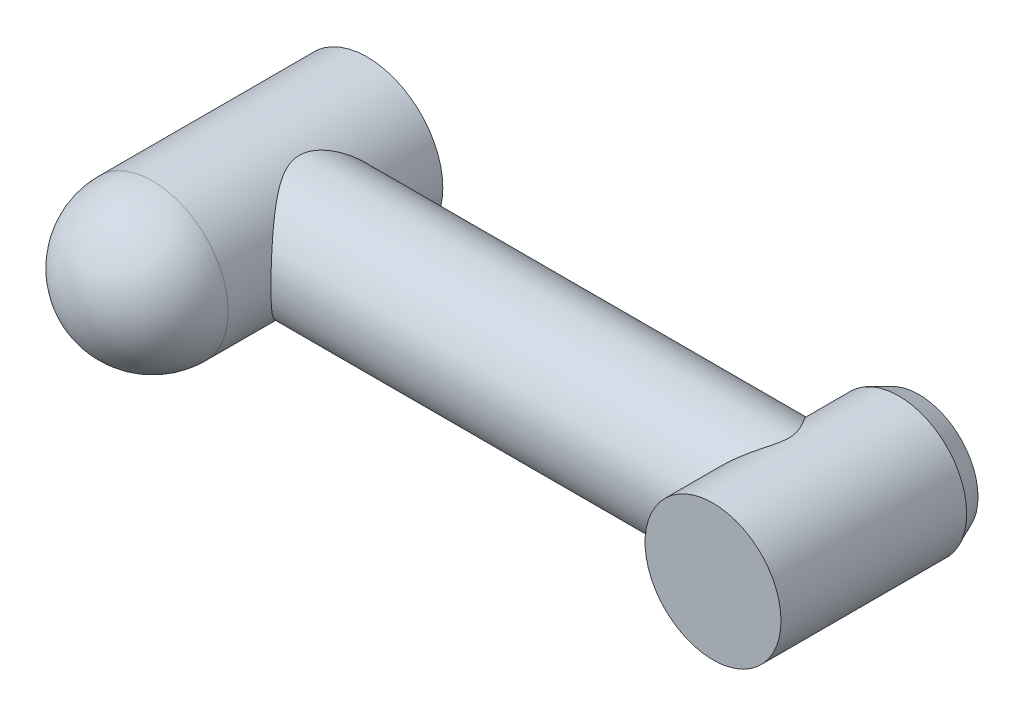
ISO-10303-21;
HEADER;
FILE_DESCRIPTION(('STEP AP214'),'2;1');
FILE_NAME('part.step','',(''),(''),'','','');
FILE_SCHEMA(('AUTOMOTIVE_DESIGN { 1 0 10303 214 1 1 1 1 }'));
ENDSEC;
DATA;
#1=APPLICATION_CONTEXT('core data for automotive mechanical design processes');
#2=APPLICATION_PROTOCOL_DEFINITION('international standard','automotive_design',2000,#1);
#3=PRODUCT_CONTEXT('',#1,'mechanical');
#4=PRODUCT('Part','Part','',(#3));
#5=PRODUCT_RELATED_PRODUCT_CATEGORY('part','',(#4));
#6=PRODUCT_DEFINITION_FORMATION('','',#4);
#7=PRODUCT_DEFINITION_CONTEXT('part definition',#1,'design');
#8=PRODUCT_DEFINITION('design','',#6,#7);
#9=PRODUCT_DEFINITION_SHAPE('','',#8);
#10=(LENGTH_UNIT() NAMED_UNIT(*) SI_UNIT(.MILLI.,.METRE.));
#11=(NAMED_UNIT(*) PLANE_ANGLE_UNIT() SI_UNIT($,.RADIAN.));
#12=(NAMED_UNIT(*) SI_UNIT($,.STERADIAN.) SOLID_ANGLE_UNIT());
#13=UNCERTAINTY_MEASURE_WITH_UNIT(LENGTH_MEASURE(1.E-05),#10,'distance_accuracy_value','');
#14=(GEOMETRIC_REPRESENTATION_CONTEXT(3) GLOBAL_UNCERTAINTY_ASSIGNED_CONTEXT((#13)) GLOBAL_UNIT_ASSIGNED_CONTEXT((#10,
#11,#12)) REPRESENTATION_CONTEXT('',''));
#15=CARTESIAN_POINT('',(0.,0.,0.));
#16=DIRECTION('',(0.,0.,1.));
#17=DIRECTION('',(1.,0.,0.));
#18=AXIS2_PLACEMENT_3D('',#15,#16,#17);
#19=CARTESIAN_POINT('',(0.,0.,230.5));
#20=DIRECTION('',(0.,0.,-1.));
#21=DIRECTION('',(-1.,0.,0.));
#22=AXIS2_PLACEMENT_3D('',#19,#20,#21);
#23=CYLINDRICAL_SURFACE('',#22,60.);
#24=CARTESIAN_POINT('',(0.,0.,170.5));
#25=DIRECTION('',(0.,0.,-1.));
#26=DIRECTION('',(-1.,0.,0.));
#27=AXIS2_PLACEMENT_3D('',#24,#25,#26);
#28=CIRCLE('',#27,60.);
#29=CARTESIAN_POINT('',(-60.,0.,170.5));
#30=VERTEX_POINT('',#29);
#31=EDGE_CURVE('E48',#30,#30,#28,.T.);
#32=ORIENTED_EDGE('',*,*,#31,.T.);
#33=EDGE_LOOP('',(#32));
#34=FACE_BOUND('',#33,.T.);
#35=CARTESIAN_POINT('',(0.,0.,0.));
#36=DIRECTION('',(0.,0.,1.));
#37=DIRECTION('',(1.,0.,0.));
#38=AXIS2_PLACEMENT_3D('',#35,#36,#37);
#39=CIRCLE('',#38,60.);
#40=CARTESIAN_POINT('',(60.,0.,0.));
#41=VERTEX_POINT('',#40);
#42=EDGE_CURVE('E57',#41,#41,#39,.T.);
#43=ORIENTED_EDGE('',*,*,#42,.T.);
#44=EDGE_LOOP('',(#43));
#45=FACE_BOUND('',#44,.T.);
#46=CARTESIAN_POINT('',(60.,0.,136.5));
#47=CARTESIAN_POINT('',(60.0000016990028,-0.601928228781382,136.500001744688));
#48=CARTESIAN_POINT('',(59.990938591183,-1.20382373694948,136.489340379008));
#49=CARTESIAN_POINT('',(59.9547426443786,-2.40637749412046,136.446749633626));
#50=CARTESIAN_POINT('',(59.9276084873752,-3.00703564967096,136.41481870262));
#51=CARTESIAN_POINT('',(59.8554201579515,-4.20587281870443,136.329832023823));
#52=CARTESIAN_POINT('',(59.810362902836,-4.80405138781683,136.276772642029));
#53=CARTESIAN_POINT('',(59.7025854606123,-5.9966510654528,136.149776281436));
#54=CARTESIAN_POINT('',(59.6398633090962,-6.59107174856334,136.075836980703));
#55=CARTESIAN_POINT('',(59.49704470274,-7.77545704488494,135.907344047787));
#56=CARTESIAN_POINT('',(59.4169322525582,-8.36541703478289,135.81277143698));
#57=CARTESIAN_POINT('',(59.2398167281469,-9.53921704084182,135.603482619148));
#58=CARTESIAN_POINT('',(59.1428117772453,-10.1230563693795,135.48876417401));
#59=CARTESIAN_POINT('',(58.8272416429912,-11.8635895803341,135.115141988051));
#60=CARTESIAN_POINT('',(58.5840704294233,-13.0097154477721,134.826711680961));
#61=CARTESIAN_POINT('',(58.0388768665048,-15.2584327986765,134.177940443527));
#62=CARTESIAN_POINT('',(57.7372378983688,-16.3612544505703,133.818067618758));
#63=CARTESIAN_POINT('',(57.0796235977744,-18.5255384112223,133.030310999894));
#64=CARTESIAN_POINT('',(56.7236488303845,-19.5870011499509,132.602427913074));
#65=CARTESIAN_POINT('',(55.9632361094469,-21.6642529274438,131.683873530652));
#66=CARTESIAN_POINT('',(55.558797861743,-22.6800416889318,131.193201853945));
#67=CARTESIAN_POINT('',(54.7073067850168,-24.6632383629957,130.153983127062));
#68=CARTESIAN_POINT('',(54.2602447602425,-25.6306357665595,129.605423585284));
#69=CARTESIAN_POINT('',(53.4746794134052,-27.2209796021024,128.634618995732));
#70=CARTESIAN_POINT('',(53.1457846466191,-27.8572851334094,128.226312188266));
#71=CARTESIAN_POINT('',(52.4726377083691,-29.1054119518997,127.386045897262));
#72=CARTESIAN_POINT('',(52.1283887819964,-29.7172383613588,126.954091407297));
#73=CARTESIAN_POINT('',(51.0750060594728,-31.5162626693242,125.624182862888));
#74=CARTESIAN_POINT('',(50.3453642100952,-32.6667494621251,124.692340987029));
#75=CARTESIAN_POINT('',(48.8446970180098,-34.8708827811849,122.745007538877));
#76=CARTESIAN_POINT('',(48.0735748547477,-35.9242856560844,121.729317014214));
#77=CARTESIAN_POINT('',(46.5061124470045,-37.9315384227759,119.622067120703));
#78=CARTESIAN_POINT('',(45.7097754993761,-38.8854012600193,118.530517648354));
#79=CARTESIAN_POINT('',(44.5002790613235,-40.250528996006,116.827907181099));
#80=CARTESIAN_POINT('',(44.090583206239,-40.6986245838529,116.243517657961));
#81=CARTESIAN_POINT('',(43.2709019356836,-41.5690538433231,115.055977250405));
#82=CARTESIAN_POINT('',(42.8609165182517,-41.991387338754,114.452826237716));
#83=CARTESIAN_POINT('',(42.0429688185456,-42.8103240518685,113.227591415116));
#84=CARTESIAN_POINT('',(41.6350072773656,-43.2069184065225,112.605501190859));
#85=CARTESIAN_POINT('',(40.8239388355854,-43.974055469358,111.342376897452));
#86=CARTESIAN_POINT('',(40.4208318762143,-44.3445984931874,110.701343057963));
#87=CARTESIAN_POINT('',(39.6233813242977,-45.0585554477164,109.401366317247));
#88=CARTESIAN_POINT('',(39.2290204975744,-45.4020269255776,108.742465639544));
#89=CARTESIAN_POINT('',(38.4516002399348,-46.0622894051371,107.404835920583));
#90=CARTESIAN_POINT('',(38.0685414095986,-46.3790789906313,106.726105829404));
#91=CARTESIAN_POINT('',(37.3180371139106,-46.9850671184351,105.348657975082));
#92=CARTESIAN_POINT('',(36.9505810387266,-47.2742845819158,104.649954352912));
#93=CARTESIAN_POINT('',(36.2357863258661,-47.8243780375567,103.23153650654));
#94=CARTESIAN_POINT('',(35.8884440950874,-48.0852590990193,102.511826069724));
#95=CARTESIAN_POINT('',(35.1967418646254,-48.5940929609231,101.001334157578));
#96=CARTESIAN_POINT('',(34.8541641051659,-48.8399860461943,100.209033711318));
#97=CARTESIAN_POINT('',(34.2060168007339,-49.2961001467494,98.5993928311455));
#98=CARTESIAN_POINT('',(33.9004427432072,-49.5063255129227,97.7820554657164));
#99=CARTESIAN_POINT('',(33.3357128627411,-49.8883392291809,96.1242891646486));
#100=CARTESIAN_POINT('',(33.0764722289052,-50.0601979541041,95.2839057359428));
#101=CARTESIAN_POINT('',(32.6132797314552,-50.3631882036835,93.5806824934261));
#102=CARTESIAN_POINT('',(32.4093277915902,-50.4943197845082,92.7178427105876));
#103=CARTESIAN_POINT('',(32.0635334320261,-50.7146234508423,90.9608773987049));
#104=CARTESIAN_POINT('',(31.9226382974755,-50.8031569859697,90.0664792897973));
#105=CARTESIAN_POINT('',(31.767008834103,-50.9004968905557,88.7161505373581));
#106=CARTESIAN_POINT('',(31.7244158822507,-50.9270346566141,88.2645236195518));
#107=CARTESIAN_POINT('',(31.6583905581338,-50.9681067767805,87.3593440595888));
#108=CARTESIAN_POINT('',(31.6349557224106,-50.982642674159,86.9057916725613));
#109=CARTESIAN_POINT('',(31.6076309143704,-50.9995873245383,85.9980897566058));
#110=CARTESIAN_POINT('',(31.6037318403365,-51.0020017249492,85.5439406043801));
#111=CARTESIAN_POINT('',(31.6155095236265,-50.9947017579526,84.6360114569342));
#112=CARTESIAN_POINT('',(31.6311855359927,-50.984987852105,84.1822314483233));
#113=CARTESIAN_POINT('',(31.6818680480592,-50.953509516958,83.2761934586466));
#114=CARTESIAN_POINT('',(31.7168736270457,-50.9317456616264,82.8239354061186));
#115=CARTESIAN_POINT('',(31.8056696688981,-50.8763409190579,81.9219853811647));
#116=CARTESIAN_POINT('',(31.859461940153,-50.8426988884359,81.4722936600081));
#117=CARTESIAN_POINT('',(32.0294422349581,-50.7358957567759,80.2600400295487));
#118=CARTESIAN_POINT('',(32.1628666099571,-50.6516043842811,79.5008066065905));
#119=CARTESIAN_POINT('',(32.4770630051097,-50.4507175456719,77.9965825165636));
#120=CARTESIAN_POINT('',(32.6578417916458,-50.3341174628891,77.2515939012446));
#121=CARTESIAN_POINT('',(32.9600485638631,-50.1363109775967,76.1463504400453));
#122=CARTESIAN_POINT('',(33.0660468403134,-50.0664978409514,75.7797101887628));
#123=CARTESIAN_POINT('',(33.2875766182136,-49.9194844461914,75.0509232843829));
#124=CARTESIAN_POINT('',(33.403105655428,-49.842286096749,74.6887754974161));
#125=CARTESIAN_POINT('',(33.7629265986134,-49.5998827917749,73.6089964857748));
#126=CARTESIAN_POINT('',(34.0204240249039,-49.4238879538893,72.8981316786486));
#127=CARTESIAN_POINT('',(34.5422225738903,-49.0604470223479,71.5530580949367));
#128=CARTESIAN_POINT('',(34.8042141676275,-48.8751399338626,70.9173599223662));
#129=CARTESIAN_POINT('',(35.3487614083546,-48.4827566017566,69.6615950238943));
#130=CARTESIAN_POINT('',(35.6313200265698,-48.2756772108612,69.0415305740169));
#131=CARTESIAN_POINT('',(36.21348265045,-47.8405250048013,67.8164766333469));
#132=CARTESIAN_POINT('',(36.5130975003405,-47.612438775407,67.2114970929409));
#133=CARTESIAN_POINT('',(37.1259767779055,-47.1361060126164,66.0166448569896));
#134=CARTESIAN_POINT('',(37.4392406498837,-46.8878602996236,65.4267715479699));
#135=CARTESIAN_POINT('',(38.0773817454971,-46.3711325258369,64.2602733461656));
#136=CARTESIAN_POINT('',(38.4022849755632,-46.1026034430055,63.6836835499283));
#137=CARTESIAN_POINT('',(39.0605404024953,-45.5462409822371,62.5447929612811));
#138=CARTESIAN_POINT('',(39.3938933177944,-45.2584059593679,61.9824933920902));
#139=CARTESIAN_POINT('',(40.4030539816053,-44.3666322635369,60.3168957886381));
#140=CARTESIAN_POINT('',(41.0882527544011,-43.7341935473179,59.2343784826));
#141=CARTESIAN_POINT('',(42.5203514950763,-42.3448780121012,57.0444907067525));
#142=CARTESIAN_POINT('',(43.2680364921754,-41.5822343054055,55.9413061988843));
#143=CARTESIAN_POINT('',(44.7604366233255,-39.9713549547925,53.7968616477341));
#144=CARTESIAN_POINT('',(45.5051514186289,-39.1231098228186,52.7556084892934));
#145=CARTESIAN_POINT('',(46.9777441919459,-37.3420065421821,50.7381993334676));
#146=CARTESIAN_POINT('',(47.7056412584662,-36.4092509014396,49.7619668989188));
#147=CARTESIAN_POINT('',(49.1335462492809,-34.4580318382516,47.8770881971078));
#148=CARTESIAN_POINT('',(49.8335573388285,-33.4395781842062,46.968434249007));
#149=CARTESIAN_POINT('',(51.1364075761642,-31.4069912306731,45.2982435786343));
#150=CARTESIAN_POINT('',(51.7424545420775,-30.3998039918888,44.5307650167732));
#151=CARTESIAN_POINT('',(52.9124226413697,-28.3143908992902,43.0627405222187));
#152=CARTESIAN_POINT('',(53.4763433127977,-27.2361642667118,42.3621953234836));
#153=CARTESIAN_POINT('',(54.5523353420667,-25.0113676255313,41.0353194828715));
#154=CARTESIAN_POINT('',(55.0644419362061,-23.8648449163711,40.4089383555055));
#155=CARTESIAN_POINT('',(56.0276468555526,-21.5063773310798,39.23761511881));
#156=CARTESIAN_POINT('',(56.478756516998,-20.2944446700849,38.692657874925));
#157=CARTESIAN_POINT('',(57.2410731875537,-18.0180583971792,37.7758560156496));
#158=CARTESIAN_POINT('',(57.5630650084877,-16.9627256422854,37.3902982019261));
#159=CARTESIAN_POINT('',(58.1528220427973,-14.8151516315462,36.6861932149717));
#160=CARTESIAN_POINT('',(58.4205926528863,-13.7229140615285,36.3676393726187));
#161=CARTESIAN_POINT('',(58.8969386846675,-11.5079567384847,35.8021873039512));
#162=CARTESIAN_POINT('',(59.105544775467,-10.3852531100768,35.5552519512594));
#163=CARTESIAN_POINT('',(59.4596424240504,-8.11600047833874,35.1367044248311));
#164=CARTESIAN_POINT('',(59.6051333173088,-6.96945122407649,34.9650930441633));
#165=CARTESIAN_POINT('',(59.8303886480648,-4.65621493093314,34.6996026077104));
#166=CARTESIAN_POINT('',(59.9098861642193,-3.48946540978627,34.6060392228566));
#167=CARTESIAN_POINT('',(60.0004089708273,-1.14962077460204,34.4995110785759));
#168=CARTESIAN_POINT('',(60.0114341734912,0.0234743475691851,34.4865464224859));
#169=CARTESIAN_POINT('',(59.9647656313801,2.36639603508192,34.5414548739631));
#170=CARTESIAN_POINT('',(59.9070711398552,3.53622256476645,34.6093288599718));
#171=CARTESIAN_POINT('',(59.7242448413245,5.8631517023647,34.8246740574));
#172=CARTESIAN_POINT('',(59.59911466552,7.02025461735906,34.9721433434892));
#173=CARTESIAN_POINT('',(59.2939714990952,9.24133291363725,35.33244473327));
#174=CARTESIAN_POINT('',(59.1178740702416,10.3066113162256,35.5406196534778));
#175=CARTESIAN_POINT('',(58.7119588793188,12.4118936319,36.0216132108837));
#176=CARTESIAN_POINT('',(58.482144987397,13.4518993598675,36.2944271910056));
#177=CARTESIAN_POINT('',(57.9725734187682,15.5014866423223,36.9011688222239));
#178=CARTESIAN_POINT('',(57.6928086810682,16.5110638718593,37.2351051136668));
#179=CARTESIAN_POINT('',(57.0876204116586,18.4954083501375,37.9601616906407));
#180=CARTESIAN_POINT('',(56.7621903508331,19.4701705960715,38.3512901537052));
#181=CARTESIAN_POINT('',(55.9543887511719,21.7012750459559,39.3265074644919));
#182=CARTESIAN_POINT('',(55.455928231889,22.9427668397205,39.9313831945074));
#183=CARTESIAN_POINT('',(54.3966129086768,25.3523592672962,41.2266400070653));
#184=CARTESIAN_POINT('',(53.8357408548031,26.5204394705661,41.9170447349985));
#185=CARTESIAN_POINT('',(52.6613407103926,28.7821067926307,43.3763138456111));
#186=CARTESIAN_POINT('',(52.0477131295118,29.8755458617249,44.1453270137603));
#187=CARTESIAN_POINT('',(50.7793955835645,31.983856929797,45.7534135245157));
#188=CARTESIAN_POINT('',(50.1247055619713,32.9987288206145,46.5924869635679));
#189=CARTESIAN_POINT('',(48.6171205236475,35.1931936282864,48.5525966309581));
#190=CARTESIAN_POINT('',(47.7555187787576,36.3507328812386,49.6917598331887));
#191=CARTESIAN_POINT('',(46.4423523232287,37.9947491876261,51.4698528764276));
#192=CARTESIAN_POINT('',(46.0010280156662,38.5275249622439,52.0743088397932));
#193=CARTESIAN_POINT('',(45.1140377333124,39.5624538671383,53.3059136047462));
#194=CARTESIAN_POINT('',(44.6683718449771,40.064607605766,53.9330619551218));
#195=CARTESIAN_POINT('',(43.7755815040018,41.038210569651,55.2095788707251));
#196=CARTESIAN_POINT('',(43.3284572120372,41.5096630648246,55.8589450583091));
#197=CARTESIAN_POINT('',(42.4357111867218,42.4219008361925,57.1799250257581));
#198=CARTESIAN_POINT('',(41.9900895041595,42.8626850854858,57.85153954948));
#199=CARTESIAN_POINT('',(41.1039362091969,43.7131942971771,59.2168638745918));
#200=CARTESIAN_POINT('',(40.6634023185742,44.1229336572787,59.910563219062));
#201=CARTESIAN_POINT('',(39.7910907679571,44.9111864440101,61.3207171087514));
#202=CARTESIAN_POINT('',(39.3593122201631,45.2897030487176,62.0371693277115));
#203=CARTESIAN_POINT('',(38.4159664574296,46.094216692092,63.6526676634546));
#204=CARTESIAN_POINT('',(37.9075661655904,46.5125314109318,64.5574214796273));
#205=CARTESIAN_POINT('',(36.9198039624893,47.3003924308968,66.4034061980593));
#206=CARTESIAN_POINT('',(36.4404414266753,47.6699397811258,67.3446363150615));
#207=CARTESIAN_POINT('',(35.5234342551012,48.35714284719,69.2635128329203));
#208=CARTESIAN_POINT('',(35.085716462952,48.6748902868205,70.241091015653));
#209=CARTESIAN_POINT('',(34.2656321620888,49.2556485871084,72.2350670902585));
#210=CARTESIAN_POINT('',(33.8832485046041,49.518676417194,73.2514528312152));
#211=CARTESIAN_POINT('',(33.2795811494356,49.9256070864136,75.0569564854494));
#212=CARTESIAN_POINT('',(33.0421129497751,50.0827693892625,75.8376688516394));
#213=CARTESIAN_POINT('',(32.6149543088861,50.3619891548517,77.4183045171422));
#214=CARTESIAN_POINT('',(32.4252580254018,50.4840509104649,78.2182254542283));
#215=CARTESIAN_POINT('',(32.1013591328088,50.6906281224531,79.8324762639301));
#216=CARTESIAN_POINT('',(31.9670477265874,50.7752172140255,80.6467745789106));
#217=CARTESIAN_POINT('',(31.7595185760057,50.9052860659427,82.2863020453545));
#218=CARTESIAN_POINT('',(31.6862984390904,50.9507673578926,83.1115307674577));
#219=CARTESIAN_POINT('',(31.6044349514742,51.0015894965328,84.7712664268398));
#220=CARTESIAN_POINT('',(31.5961675686738,51.006696645464,85.6057994215467));
#221=CARTESIAN_POINT('',(31.6456425630219,50.9760148857895,87.2721113145405));
#222=CARTESIAN_POINT('',(31.7033847781936,50.9402260775358,88.1038902195803));
#223=CARTESIAN_POINT('',(31.8819901323243,50.828630145925,89.7590468174903));
#224=CARTESIAN_POINT('',(32.0029440569988,50.7527654632289,90.5824106858969));
#225=CARTESIAN_POINT('',(32.3022461672095,50.5627936101713,92.2140926012997));
#226=CARTESIAN_POINT('',(32.4806039007546,50.4486800777256,93.0224081216184));
#227=CARTESIAN_POINT('',(32.9544634925807,50.1408733982303,94.8835918992239));
#228=CARTESIAN_POINT('',(33.2691999864242,49.9333479949782,95.9292741578807));
#229=CARTESIAN_POINT('',(33.9690109061735,49.4599264030424,97.9831025320429));
#230=CARTESIAN_POINT('',(34.3541149775487,49.1940056031379,98.991232610708));
#231=CARTESIAN_POINT('',(35.1791052092895,48.6074836117474,100.971997831806));
#232=CARTESIAN_POINT('',(35.6191561805948,48.2867167951201,101.944514296865));
#233=CARTESIAN_POINT('',(36.538897473557,47.5945394177989,103.851817507669));
#234=CARTESIAN_POINT('',(37.0185876278058,47.2231290709836,104.786604412732));
#235=CARTESIAN_POINT('',(37.9092375243432,46.5096625707101,106.440279500475));
#236=CARTESIAN_POINT('',(38.3152344347341,46.1761271507411,107.165565215436));
#237=CARTESIAN_POINT('',(39.1405272786443,45.4786871113815,108.593735746481));
#238=CARTESIAN_POINT('',(39.5598247515088,45.114778968785,109.296617950676));
#239=CARTESIAN_POINT('',(40.4076407442474,44.3570292298406,110.6808823714));
#240=CARTESIAN_POINT('',(40.8361637051934,43.9631729748025,111.362253825146));
#241=CARTESIAN_POINT('',(41.6985708063181,43.1460550043251,112.703576997377));
#242=CARTESIAN_POINT('',(42.1324547460593,42.7227943855442,113.363529513353));
#243=CARTESIAN_POINT('',(43.0023682228689,41.8470697390214,114.662237311446));
#244=CARTESIAN_POINT('',(43.438397650704,41.3946071841142,115.300993660162));
#245=CARTESIAN_POINT('',(44.3097465931627,40.4605281573044,116.557340347918));
#246=CARTESIAN_POINT('',(44.7450660966161,39.9789112311396,117.174930356926));
#247=CARTESIAN_POINT('',(45.6121838044054,38.9866976798693,118.388469564918));
#248=CARTESIAN_POINT('',(46.0439832572567,38.476111891157,118.984426721091));
#249=CARTESIAN_POINT('',(46.9017333858359,37.4257573725246,120.154447956155));
#250=CARTESIAN_POINT('',(47.3276837354072,36.8859870234404,120.728510817326));
#251=CARTESIAN_POINT('',(48.4722365170899,35.3817212422548,122.255487172974));
#252=CARTESIAN_POINT('',(49.1829361079735,34.3888254501452,123.186652121967));
#253=CARTESIAN_POINT('',(50.5683567158088,32.3170931780404,124.977591021849));
#254=CARTESIAN_POINT('',(51.2430766907507,31.238254211289,125.837362905516));
#255=CARTESIAN_POINT('',(52.5438617880722,28.9968800947269,127.477451068981));
#256=CARTESIAN_POINT('',(53.1699949782118,27.834466597108,128.257878999665));
#257=CARTESIAN_POINT('',(54.3624559527958,25.4268889745745,129.731936515126));
#258=CARTESIAN_POINT('',(54.928799466491,24.1817467547825,130.425588937415));
#259=CARTESIAN_POINT('',(55.8796537294604,21.8787457956903,131.582757924634));
#260=CARTESIAN_POINT('',(56.2775495281226,20.8353917690828,132.064204295715));
#261=CARTESIAN_POINT('',(57.0217770816656,18.702723889323,132.960991318157));
#262=CARTESIAN_POINT('',(57.3681110383668,17.6134120012381,133.37633479233));
#263=CARTESIAN_POINT('',(58.0026917484509,15.3953423949838,134.134919141161));
#264=CARTESIAN_POINT('',(58.2910217811422,14.2666440001343,134.478263419363));
#265=CARTESIAN_POINT('',(58.8046069063445,11.9748068532626,135.088395536297));
#266=CARTESIAN_POINT('',(59.0298790975538,10.8116775322694,135.355204128852));
#267=CARTESIAN_POINT('',(59.349254865252,8.84883368457987,135.732862428388));
#268=CARTESIAN_POINT('',(59.4620896959247,8.05636433074545,135.866097519287));
#269=CARTESIAN_POINT('',(59.656399494723,6.4620905758569,136.095352881692));
#270=CARTESIAN_POINT('',(59.7378710288592,5.66028516248732,136.191369078082));
#271=CARTESIAN_POINT('',(59.8685875178258,4.05027991019745,136.345348054519));
#272=CARTESIAN_POINT('',(59.9178266124038,3.24207893550446,136.403303914736));
#273=CARTESIAN_POINT('',(59.9835296651962,1.62256522833785,136.480626305908));
#274=CARTESIAN_POINT('',(59.9999977101573,0.811252896513804,136.499997648584));
#275=CARTESIAN_POINT('',(60.,0.,136.5));
#276=B_SPLINE_CURVE_WITH_KNOTS('',3,(#46,#47,#48,#49,#50,#51,#52,#53,#54,#55,#56,#57,#58,#59,
#60,#61,#62,#63,#64,#65,#66,#67,#68,#69,#70,#71,#72,#73,#74,#75,#76,#77,#78,#79,#80,#81,#82,#83,
#84,#85,#86,#87,#88,#89,#90,#91,#92,#93,#94,#95,#96,#97,#98,#99,#100,#101,#102,#103,#104,#105,
#106,#107,#108,#109,#110,#111,#112,#113,#114,#115,#116,#117,#118,#119,#120,#121,#122,#123,#124,
#125,#126,#127,#128,#129,#130,#131,#132,#133,#134,#135,#136,#137,#138,#139,#140,#141,#142,#143,
#144,#145,#146,#147,#148,#149,#150,#151,#152,#153,#154,#155,#156,#157,#158,#159,#160,#161,#162,
#163,#164,#165,#166,#167,#168,#169,#170,#171,#172,#173,#174,#175,#176,#177,#178,#179,#180,#181,
#182,#183,#184,#185,#186,#187,#188,#189,#190,#191,#192,#193,#194,#195,#196,#197,#198,#199,#200,
#201,#202,#203,#204,#205,#206,#207,#208,#209,#210,#211,#212,#213,#214,#215,#216,#217,#218,#219,
#220,#221,#222,#223,#224,#225,#226,#227,#228,#229,#230,#231,#232,#233,#234,#235,#236,#237,#238,
#239,#240,#241,#242,#243,#244,#245,#246,#247,#248,#249,#250,#251,#252,#253,#254,#255,#256,#257,
#258,#259,#260,#261,#262,#263,#264,#265,#266,#267,#268,#269,#270,#271,#272,#273,#274,#275),
.UNSPECIFIED.,.T.,.F.,(4,2,2,2,2,2,2,2,2,2,2,2,2,2,2,2,2,2,2,2,2,2,2,2,2,2,2,2,2,2,2,2,2,2,2,2,
2,2,2,2,2,2,2,2,2,2,2,2,2,2,2,2,2,2,2,2,2,2,2,2,2,2,2,2,2,2,2,2,2,2,2,2,2,2,2,2,2,2,2,2,2,2,2,2,
2,2,2,2,2,2,2,2,2,2,2,2,2,2,2,2,2,2,2,2,2,2,2,2,2,2,2,2,2,2,4),(0.,1.80556576549967,
3.61126323505959,5.41727141114242,7.22348050198624,9.03135801051498,10.8394364934332,
14.4543257683192,18.0462680115357,21.6381729026772,25.2300995965224,28.8228029820555,
31.2954253817676,33.7675276480086,38.7127087321717,43.669980748805,48.6266072532208,
51.1542361369822,53.6818823057867,56.2103942776343,58.7388756077873,61.2618283257889,
63.7849148711423,66.306257311279,68.8271479448589,71.5181158623682,74.2087552885961,
76.8944180425064,79.5800770924915,82.3048288411022,83.6675757527587,85.0301474071467,
86.3920841799377,87.7539691238753,89.1157892035571,90.4777404068853,92.8015347638407,
95.1256613446831,96.2894412136227,97.4529211177222,99.7802028300518,101.915690126417,
104.051486541672,106.188656384769,108.325739297868,110.467938272541,112.610320002349,
116.893171532629,121.496013058843,126.099365325251,130.697206807018,135.294524905933,
139.502299415819,143.710120060794,147.915059656505,152.119216689768,155.6220928121,
159.124620116676,162.625328484128,166.126073708849,169.640910234547,173.155751266673,
176.670630493537,180.18542470282,183.480713933253,186.775765818826,190.071283858378,
193.367273564031,197.765527291885,202.164999688194,206.572959004584,210.98092438913,
216.488361417069,219.243806941931,221.999197708037,224.754294522419,227.509483544607,
230.263386869222,233.017009534886,236.371961461869,239.72684120397,243.075714262631,
246.423547228821,248.914606230236,251.405360440046,253.891198274833,256.376938750655,
258.87705698551,261.377169085497,263.880881796435,266.38501116677,269.714312930651,
273.045020558414,276.385969947905,279.726905228276,282.412843175174,285.099093122418,
287.786666477598,290.474139651421,293.161477385081,295.848857001669,298.53523789344,
301.221767979292,305.823997331777,310.42635989766,315.0221537854,319.616735599632,
323.261369843546,326.90584840773,330.54505645786,334.183276746105,336.616335300932,
339.049660177327,341.483427339203,343.916890976676),.UNSPECIFIED.);
#277=CARTESIAN_POINT('',(60.,0.,136.5));
#278=VERTEX_POINT('',#277);
#279=EDGE_CURVE('E44',#278,#278,#276,.T.);
#280=ORIENTED_EDGE('',*,*,#279,.F.);
#281=EDGE_LOOP('',(#280));
#282=FACE_BOUND('',#281,.T.);
#283=ADVANCED_FACE('F33',(#34,#45,#282),#23,.T.);
#284=CARTESIAN_POINT('',(0.,0.,0.));
#285=DIRECTION('',(0.,0.,1.));
#286=DIRECTION('',(1.,0.,0.));
#287=AXIS2_PLACEMENT_3D('',#284,#285,#286);
#288=PLANE('',#287);
#289=ORIENTED_EDGE('',*,*,#42,.F.);
#290=EDGE_LOOP('',(#289));
#291=FACE_BOUND('',#290,.T.);
#292=ADVANCED_FACE('F82',(#291),#288,.F.);
#293=CARTESIAN_POINT('',(0.,0.,170.5));
#294=DIRECTION('',(0.,0.,1.));
#295=DIRECTION('',(1.,0.,0.));
#296=AXIS2_PLACEMENT_3D('',#293,#294,#295);
#297=SPHERICAL_SURFACE('',#296,60.);
#298=ORIENTED_EDGE('',*,*,#31,.F.);
#299=EDGE_LOOP('',(#298));
#300=FACE_BOUND('',#299,.T.);
#301=ADVANCED_FACE('F87',(#300),#297,.T.);
#302=CARTESIAN_POINT('',(438.15,0.,85.5));
#303=DIRECTION('',(-1.,0.,0.));
#304=DIRECTION('',(0.,0.,1.));
#305=AXIS2_PLACEMENT_3D('',#302,#303,#304);
#306=CYLINDRICAL_SURFACE('',#305,51.);
#307=CARTESIAN_POINT('',(384.175,0.,136.5));
#308=CARTESIAN_POINT('',(384.175008567837,1.16216833662785,136.499991363593));
#309=CARTESIAN_POINT('',(384.21261449314,2.32447110122438,136.460196427347));
#310=CARTESIAN_POINT('',(384.362210518301,4.63894572327149,136.301833948972));
#311=CARTESIAN_POINT('',(384.47421228886,5.79111596246385,136.183254047607));
#312=CARTESIAN_POINT('',(384.770229415357,8.07646994062947,135.869653194199));
#313=CARTESIAN_POINT('',(384.954299287674,9.20963862744668,135.67457437388));
#314=CARTESIAN_POINT('',(385.390596853786,11.4475263842736,135.211768705011));
#315=CARTESIAN_POINT('',(385.642823557903,12.5522458671282,134.94404291134));
#316=CARTESIAN_POINT('',(386.208721241677,14.7190349500372,134.342666740921));
#317=CARTESIAN_POINT('',(386.521978592509,15.7813366628627,134.00946002911));
#318=CARTESIAN_POINT('',(387.205620858209,17.8654335469899,133.281218930187));
#319=CARTESIAN_POINT('',(387.576004728933,18.887229458218,132.886185673125));
#320=CARTESIAN_POINT('',(388.368279227206,20.8862888335811,132.039674677878));
#321=CARTESIAN_POINT('',(388.790167796861,21.8635540748193,131.588199194853));
#322=CARTESIAN_POINT('',(389.680001559554,23.7711557010081,130.633910316828));
#323=CARTESIAN_POINT('',(390.147957329635,24.7014812340772,130.131085130925));
#324=CARTESIAN_POINT('',(390.979558576426,26.2445075548982,129.235212781341));
#325=CARTESIAN_POINT('',(391.332983406337,26.8695840881424,128.853831375099));
#326=CARTESIAN_POINT('',(392.058015618994,28.0951322114224,128.069855476238));
#327=CARTESIAN_POINT('',(392.429619180117,28.6956089245969,127.667265440845));
#328=CARTESIAN_POINT('',(393.569540804119,30.4605499600143,126.429457929331));
#329=CARTESIAN_POINT('',(394.362825071122,31.5882591199146,125.564358670672));
#330=CARTESIAN_POINT('',(396.004882792995,33.748129581109,123.762880099073));
#331=CARTESIAN_POINT('',(396.853807151443,34.7800110054783,122.82630570244));
#332=CARTESIAN_POINT('',(398.593426315953,36.7464361609817,120.892105692498));
#333=CARTESIAN_POINT('',(399.484117390544,37.6809885636291,119.894485530647));
#334=CARTESIAN_POINT('',(400.975466837663,39.1411083212302,118.206895910399));
#335=CARTESIAN_POINT('',(401.567304953432,39.6944354646039,117.532888363783));
#336=CARTESIAN_POINT('',(402.760780862041,40.7620500949958,116.162836621296));
#337=CARTESIAN_POINT('',(403.362419270537,41.2763351178071,115.466791038382));
#338=CARTESIAN_POINT('',(404.572695983587,42.2667378085748,114.052906213676));
#339=CARTESIAN_POINT('',(405.18133888071,42.7428285866523,113.335052099828));
#340=CARTESIAN_POINT('',(406.401767290346,43.6569755402028,111.878173655974));
#341=CARTESIAN_POINT('',(407.013552685642,44.0950331235705,111.139150110956));
#342=CARTESIAN_POINT('',(408.234921646691,44.9325677486476,109.641230428533));
#343=CARTESIAN_POINT('',(408.844507004158,45.3321332511821,108.882385210912));
#344=CARTESIAN_POINT('',(410.058288901872,46.094140118042,107.341906246824));
#345=CARTESIAN_POINT('',(410.662484885057,46.456577684396,106.560270179471));
#346=CARTESIAN_POINT('',(411.858751838946,47.1438877058472,104.973084966251));
#347=CARTESIAN_POINT('',(412.450835417561,47.4688010490386,104.16756307405));
#348=CARTESIAN_POINT('',(413.615419560718,48.0810464729684,102.528748197121));
#349=CARTESIAN_POINT('',(414.187925710984,48.3683893402985,101.695463269833));
#350=CARTESIAN_POINT('',(415.123665770932,48.818701858993,100.26824001479));
#351=CARTESIAN_POINT('',(415.495240809426,48.9920465152482,99.6830416929386));
#352=CARTESIAN_POINT('',(416.219064865996,49.3203044971932,98.4956565541741));
#353=CARTESIAN_POINT('',(416.571313791189,49.4752177343035,97.8934696556327));
#354=CARTESIAN_POINT('',(417.249811620592,49.7656393445798,96.6703221934093));
#355=CARTESIAN_POINT('',(417.576072095777,49.9011563752796,96.0493701564254));
#356=CARTESIAN_POINT('',(418.194177132883,50.1515387530876,94.7864105845475));
#357=CARTESIAN_POINT('',(418.4860283924,50.26640812146,94.1444071784039));
#358=CARTESIAN_POINT('',(418.963679757817,50.4503304948903,92.9850940506878));
#359=CARTESIAN_POINT('',(419.158561916479,50.5238758758326,92.4722587752131));
#360=CARTESIAN_POINT('',(419.51489809357,50.656388940882,91.4333218673315));
#361=CARTESIAN_POINT('',(419.676364340186,50.715361959124,90.9072251671391));
#362=CARTESIAN_POINT('',(419.959012085028,50.8174301709106,89.8442939692008));
#363=CARTESIAN_POINT('',(420.080308217901,50.8605705852185,89.3074947438191));
#364=CARTESIAN_POINT('',(420.277121825039,50.93006830183,88.2244142426342));
#365=CARTESIAN_POINT('',(420.352644103446,50.9564273654159,87.6781339680961));
#366=CARTESIAN_POINT('',(420.453962715343,50.9917042658117,86.5743250395853));
#367=CARTESIAN_POINT('',(420.479209201279,51.0004292606338,86.0167386674711));
#368=CARTESIAN_POINT('',(420.476637831294,50.999538146299,84.9017200299112));
#369=CARTESIAN_POINT('',(420.44882099128,50.9899223882796,84.3442877617194));
#370=CARTESIAN_POINT('',(420.341879845234,50.952670145813,83.2340417717707));
#371=CARTESIAN_POINT('',(420.262662480133,50.9250009757109,82.6812382725698));
#372=CARTESIAN_POINT('',(420.057638314202,50.8525198495003,81.5855414869308));
#373=CARTESIAN_POINT('',(419.931821158899,50.8077040833451,81.0426504311906));
#374=CARTESIAN_POINT('',(419.590734805571,50.6842895206007,79.7883612538546));
#375=CARTESIAN_POINT('',(419.359607202647,50.5993939803939,79.0819176222744));
#376=CARTESIAN_POINT('',(418.841362027599,50.4039047504299,77.6936791787144));
#377=CARTESIAN_POINT('',(418.554214640477,50.2932973702184,77.0118977225669));
#378=CARTESIAN_POINT('',(417.93665070446,50.0482956984954,75.6696769340056));
#379=CARTESIAN_POINT('',(417.606073561833,49.9138124366678,75.0093287514875));
#380=CARTESIAN_POINT('',(416.913488556659,49.6231028787349,73.7105794729115));
#381=CARTESIAN_POINT('',(416.551484561679,49.4668792566994,73.072175689711));
#382=CARTESIAN_POINT('',(415.757300430252,49.1129266186918,71.7356770984985));
#383=CARTESIAN_POINT('',(415.322018915173,48.9124487928512,71.0401658430735));
#384=CARTESIAN_POINT('',(414.430636558635,48.4864588893042,69.6703511257145));
#385=CARTESIAN_POINT('',(413.974530555487,48.2609405848529,68.9960529925242));
#386=CARTESIAN_POINT('',(413.047490980018,47.7853156608263,67.6656788295057));
#387=CARTESIAN_POINT('',(412.576544502076,47.5351872148403,67.009619649003));
#388=CARTESIAN_POINT('',(411.625008621607,47.0108562406277,65.7144653790507));
#389=CARTESIAN_POINT('',(411.144420045481,46.736655768816,65.075368846586));
#390=CARTESIAN_POINT('',(410.17655594115,46.1638793173444,63.811799599364));
#391=CARTESIAN_POINT('',(409.689272074199,45.86527010714,63.1873483620569));
#392=CARTESIAN_POINT('',(408.711603840027,45.2439716310842,61.9530172096917));
#393=CARTESIAN_POINT('',(408.221219432541,44.9212820519245,61.3431374843591));
#394=CARTESIAN_POINT('',(407.239990300573,44.2518310426529,60.1376147294075));
#395=CARTESIAN_POINT('',(406.749145852772,43.905079691362,59.5419658777406));
#396=CARTESIAN_POINT('',(405.768872227111,43.187177612897,58.364355424569));
#397=CARTESIAN_POINT('',(405.279443064909,42.8160266168777,57.7823939739734));
#398=CARTESIAN_POINT('',(404.234775845311,41.9947607784304,56.5506850938765));
#399=CARTESIAN_POINT('',(403.680031644187,41.540906105616,55.9030065792804));
#400=CARTESIAN_POINT('',(402.577313028077,40.6006116223058,54.625751781785));
#401=CARTESIAN_POINT('',(402.029338759969,40.1141711063026,53.9961758912429));
#402=CARTESIAN_POINT('',(400.942350527432,39.1080565075387,52.7555661405123));
#403=CARTESIAN_POINT('',(400.403339751647,38.5883709039763,52.1445388175209));
#404=CARTESIAN_POINT('',(399.336818346252,37.515460194888,50.9422305710913));
#405=CARTESIAN_POINT('',(398.809307439449,36.9622358989956,50.3509491715148));
#406=CARTESIAN_POINT('',(397.769398830138,35.823187301159,49.1907960604353));
#407=CARTESIAN_POINT('',(397.256966376465,35.2374487093105,48.6218716067493));
#408=CARTESIAN_POINT('',(396.248277109378,34.031814270642,47.5064434500648));
#409=CARTESIAN_POINT('',(395.75202080682,33.4119173467356,46.9599404550124));
#410=CARTESIAN_POINT('',(394.291646483715,31.5010027580516,45.3571420570525));
#411=CARTESIAN_POINT('',(393.355026066016,30.1577892714313,44.3365601214413));
#412=CARTESIAN_POINT('',(391.87940798872,27.8127565238799,42.7363802615824));
#413=CARTESIAN_POINT('',(391.313275657737,26.8496210186442,42.1245984050312));
#414=CARTESIAN_POINT('',(390.229618892387,24.8639503821336,40.9566519837165));
#415=CARTESIAN_POINT('',(389.712087197472,23.8414241604179,40.4004791106075));
#416=CARTESIAN_POINT('',(388.732980301484,21.7394345979208,39.3504917723132));
#417=CARTESIAN_POINT('',(388.271391406018,20.6599852847283,38.8566620447402));
#418=CARTESIAN_POINT('',(387.411405908751,18.4473161274382,37.9381418342261));
#419=CARTESIAN_POINT('',(387.013011008114,17.3140948368808,37.5134532125358));
#420=CARTESIAN_POINT('',(386.466718578794,15.5728838950453,36.9318478564774));
#421=CARTESIAN_POINT('',(386.292414733779,14.982460884722,36.7464149074371));
#422=CARTESIAN_POINT('',(385.962765608747,13.790408323946,36.3959231669178));
#423=CARTESIAN_POINT('',(385.807417955531,13.1887801871991,36.2308618250089));
#424=CARTESIAN_POINT('',(385.516523207043,11.9752729639153,35.9219306826301));
#425=CARTESIAN_POINT('',(385.380979300127,11.363392244374,35.7780642944668));
#426=CARTESIAN_POINT('',(385.130535306419,10.1307664545403,35.5123517035893));
#427=CARTESIAN_POINT('',(385.015632421576,9.51002259804888,35.3905025162584));
#428=CARTESIAN_POINT('',(384.807245062091,8.26143994468591,35.169589482197));
#429=CARTESIAN_POINT('',(384.713743796269,7.6336071183051,35.0705077724264));
#430=CARTESIAN_POINT('',(384.548658275113,6.37193213140098,34.8956124132824));
#431=CARTESIAN_POINT('',(384.477071048436,5.73809079760294,34.8197956093957));
#432=CARTESIAN_POINT('',(384.356280067398,4.46592202227584,34.6918891893386));
#433=CARTESIAN_POINT('',(384.307074818412,3.82759488319204,34.6397979888163));
#434=CARTESIAN_POINT('',(384.231372483793,2.54816076940695,34.5596630153593));
#435=CARTESIAN_POINT('',(384.204874471993,1.90705390915498,34.5316182616356));
#436=CARTESIAN_POINT('',(384.164100155666,0.167411497048121,34.4884631311465));
#437=CARTESIAN_POINT('',(384.171894361707,-0.932394139172794,34.4967110418317));
#438=CARTESIAN_POINT('',(384.254434929867,-3.12638249494674,34.5840742235865));
#439=CARTESIAN_POINT('',(384.329173668951,-4.22056584044794,34.6631814258438));
#440=CARTESIAN_POINT('',(384.544069344362,-6.39519525563545,34.8907461189026));
#441=CARTESIAN_POINT('',(384.684226531197,-7.47564127270069,35.0392038752703));
#442=CARTESIAN_POINT('',(385.027268773585,-9.61509208934046,35.4028186532139));
#443=CARTESIAN_POINT('',(385.230155693506,-10.6740962506521,35.6179776571952));
#444=CARTESIAN_POINT('',(385.687029497451,-12.7281721940781,36.1029451626988));
#445=CARTESIAN_POINT('',(385.939029609088,-13.7241915671274,36.3706310189821));
#446=CARTESIAN_POINT('',(386.494220856684,-15.685004973909,36.9610570328422));
#447=CARTESIAN_POINT('',(386.797408971578,-16.6498008464188,37.2837939413723));
#448=CARTESIAN_POINT('',(387.450787390176,-18.5444014348278,37.9802769315803));
#449=CARTESIAN_POINT('',(387.800981193988,-19.4742035384357,38.3540268117887));
#450=CARTESIAN_POINT('',(388.544105884328,-21.2961028483366,39.1484752688299));
#451=CARTESIAN_POINT('',(388.937045658755,-22.1881921594982,39.5691836099142));
#452=CARTESIAN_POINT('',(389.646925962929,-23.6904711445749,40.3307522758648));
#453=CARTESIAN_POINT('',(389.954721378244,-24.3102273917928,40.6613991134506));
#454=CARTESIAN_POINT('',(390.588682920273,-25.5282806080991,41.343527313088));
#455=CARTESIAN_POINT('',(390.91484561225,-26.1265815553657,41.69500478039));
#456=CARTESIAN_POINT('',(391.918943584978,-27.8894064656564,42.7789943499797));
#457=CARTESIAN_POINT('',(392.622372480251,-29.0216086197727,43.5409390703841));
#458=CARTESIAN_POINT('',(394.086930359517,-31.2005592034946,45.1347600310051));
#459=CARTESIAN_POINT('',(394.848194896425,-32.2470941403789,45.9668010899265));
#460=CARTESIAN_POINT('',(396.41646772801,-34.2524840348603,47.6910622540016));
#461=CARTESIAN_POINT('',(397.223474793649,-35.2113413464264,48.5832807423934));
#462=CARTESIAN_POINT('',(398.600070806165,-36.7393992251432,50.1168201301623));
#463=CARTESIAN_POINT('',(399.159805161551,-37.3325034114265,50.7434088970809));
#464=CARTESIAN_POINT('',(400.292579876412,-38.4807314135922,52.0191129448943));
#465=CARTESIAN_POINT('',(400.865621178154,-39.035852528837,52.6682298226268));
#466=CARTESIAN_POINT('',(402.022421318465,-40.1088693148037,53.9880602695922));
#467=CARTESIAN_POINT('',(402.606185266444,-40.6267466288636,54.6587842558662));
#468=CARTESIAN_POINT('',(403.781279862339,-41.6255479767611,56.0207380262676));
#469=CARTESIAN_POINT('',(404.372610291906,-42.1064730741529,56.7119672194224));
#470=CARTESIAN_POINT('',(405.559150270853,-43.0314109420935,58.1138331336667));
#471=CARTESIAN_POINT('',(406.154354890065,-43.475463371302,58.8244478818611));
#472=CARTESIAN_POINT('',(407.345922351484,-44.3277103837534,60.2659896219152));
#473=CARTESIAN_POINT('',(407.942285249662,-44.7359031877416,60.9969176192957));
#474=CARTESIAN_POINT('',(409.131785366147,-45.5164751126045,62.479317679979));
#475=CARTESIAN_POINT('',(409.724924398417,-45.8888768981907,63.2307763497628));
#476=CARTESIAN_POINT('',(410.903404397358,-46.5982439654404,64.7560573583061));
#477=CARTESIAN_POINT('',(411.488746476619,-46.9352143513544,65.5298764552884));
#478=CARTESIAN_POINT('',(412.556598356446,-47.5246381762618,66.9817715895764));
#479=CARTESIAN_POINT('',(413.041110781457,-47.7821276081062,67.65632943836));
#480=CARTESIAN_POINT('',(413.994840201241,-48.2712740733168,69.0253951752787));
#481=CARTESIAN_POINT('',(414.464057529391,-48.5029316699913,69.7199026279621));
#482=CARTESIAN_POINT('',(415.380249568871,-48.9397237588364,71.1316496014429));
#483=CARTESIAN_POINT('',(415.827224543263,-49.144858564742,71.8488888532235));
#484=CARTESIAN_POINT('',(416.689327199544,-49.5273875781134,73.3095198431282));
#485=CARTESIAN_POINT('',(417.104461634344,-49.7047876760378,74.052905986826));
#486=CARTESIAN_POINT('',(417.782620332187,-49.9856623102971,75.3633296450882));
#487=CARTESIAN_POINT('',(418.056303985649,-50.0961194414611,75.9233313770349));
#488=CARTESIAN_POINT('',(418.572785718133,-50.3002020865413,77.0606029130918));
#489=CARTESIAN_POINT('',(418.815582055482,-50.3938266514256,77.6378736887038));
#490=CARTESIAN_POINT('',(419.261280356227,-50.5625711294725,78.8085786279993));
#491=CARTESIAN_POINT('',(419.464290650698,-50.6377414359315,79.4019637471111));
#492=CARTESIAN_POINT('',(419.82165121033,-50.7681854123772,80.6054023347392));
#493=CARTESIAN_POINT('',(419.976021450074,-50.8234672511114,81.2154488489314));
#494=CARTESIAN_POINT('',(420.198977425576,-50.9025749513859,82.3125384894201));
#495=CARTESIAN_POINT('',(420.278984173463,-50.9306534571899,82.7969513920058));
#496=CARTESIAN_POINT('',(420.400185919609,-50.973021534986,83.7712292142589));
#497=CARTESIAN_POINT('',(420.441386475241,-50.9873130813936,84.2610933430951));
#498=CARTESIAN_POINT('',(420.48288853976,-51.0017087874271,85.2424380249356));
#499=CARTESIAN_POINT('',(420.483218501572,-51.0018228170301,85.7339172152086));
#500=CARTESIAN_POINT('',(420.443035975041,-50.9878856228133,86.7150038863851));
#501=CARTESIAN_POINT('',(420.402521273423,-50.9738336313701,87.2046112644164));
#502=CARTESIAN_POINT('',(420.283005782005,-50.9320632424321,88.1758211412867));
#503=CARTESIAN_POINT('',(420.204208741974,-50.9044171871802,88.6574522136004));
#504=CARTESIAN_POINT('',(420.01173863924,-50.8361531219888,89.6127852809125));
#505=CARTESIAN_POINT('',(419.898057399787,-50.7955320706588,90.0864853894359));
#506=CARTESIAN_POINT('',(419.639967251604,-50.7020524737317,91.0249107762216));
#507=CARTESIAN_POINT('',(419.495510843218,-50.6491749998399,91.4896209556076));
#508=CARTESIAN_POINT('',(419.180479843927,-50.5320308800483,92.4085795665327));
#509=CARTESIAN_POINT('',(419.009903589004,-50.4677635084905,92.8628273294195));
#510=CARTESIAN_POINT('',(418.638704026957,-50.3254527351431,93.7809567398686));
#511=CARTESIAN_POINT('',(418.43707429014,-50.2469197006518,94.2443526359541));
#512=CARTESIAN_POINT('',(418.014130907974,-50.078929674593,95.1601019106205));
#513=CARTESIAN_POINT('',(417.792813014495,-49.989470323885,95.612452879063));
#514=CARTESIAN_POINT('',(417.333941820402,-49.8001402704518,96.5070551077893));
#515=CARTESIAN_POINT('',(417.096375477456,-49.700261169392,96.949297865371));
#516=CARTESIAN_POINT('',(416.608115750087,-49.4905908910241,97.8241088638541));
#517=CARTESIAN_POINT('',(416.357420650497,-49.3807984172495,98.2566758301031));
#518=CARTESIAN_POINT('',(415.587260151151,-49.0361065852381,99.5446928807347));
#519=CARTESIAN_POINT('',(415.051707091879,-48.7867006233528,100.386683614107));
#520=CARTESIAN_POINT('',(413.953182559371,-48.2513075828423,102.039817363907));
#521=CARTESIAN_POINT('',(413.390220126089,-47.9653325152298,102.850970395908));
#522=CARTESIAN_POINT('',(412.233099334455,-47.3503366554531,104.466017620059));
#523=CARTESIAN_POINT('',(411.638517245127,-47.0204523388368,105.269277985062));
#524=CARTESIAN_POINT('',(410.438651387304,-46.323465829312,106.851433842663));
#525=CARTESIAN_POINT('',(409.833365957533,-45.9563578162666,107.630325500085));
#526=CARTESIAN_POINT('',(408.61751288198,-45.1846410888288,109.166162562284));
#527=CARTESIAN_POINT('',(408.006941572434,-44.7800040953208,109.92309084389));
#528=CARTESIAN_POINT('',(406.78560132813,-43.9332148811054,111.415411108933));
#529=CARTESIAN_POINT('',(406.174832406676,-43.4910648078996,112.150804321944));
#530=CARTESIAN_POINT('',(404.957865367704,-42.5695256034027,113.599307825319));
#531=CARTESIAN_POINT('',(404.351661502243,-42.0901971602914,114.312451872234));
#532=CARTESIAN_POINT('',(403.146179642016,-41.0931271108779,115.717494453342));
#533=CARTESIAN_POINT('',(402.546901870658,-40.5753842694559,116.409392303404));
#534=CARTESIAN_POINT('',(401.35873146572,-39.50119267805,117.770840562493));
#535=CARTESIAN_POINT('',(400.769833097375,-38.9447661989146,118.440403506854));
#536=CARTESIAN_POINT('',(399.605144385542,-37.7924050792276,119.75637129846));
#537=CARTESIAN_POINT('',(399.029352974203,-37.1964736728128,120.402778034768));
#538=CARTESIAN_POINT('',(397.645759231422,-35.6953195159375,121.948014906729));
#539=CARTESIAN_POINT('',(396.846439425366,-34.7686730205573,122.833810685197));
#540=CARTESIAN_POINT('',(395.290108913546,-32.8310008286397,124.548674843134));
#541=CARTESIAN_POINT('',(394.533098038417,-31.8199754699162,125.377743449687));
#542=CARTESIAN_POINT('',(393.072139884968,-29.7140938150757,126.970632810284));
#543=CARTESIAN_POINT('',(392.368128456279,-28.6193422068299,127.734532598746));
#544=CARTESIAN_POINT('',(391.023029223164,-26.3456422751068,129.188982700497));
#545=CARTESIAN_POINT('',(390.381926389697,-25.1667141784759,129.879550536253));
#546=CARTESIAN_POINT('',(389.298514208127,-22.9782901655349,131.04341196086));
#547=CARTESIAN_POINT('',(388.842437933085,-21.9838168603961,131.532181032626));
#548=CARTESIAN_POINT('',(387.983437559637,-19.945898778602,132.451145141949));
#549=CARTESIAN_POINT('',(387.580510280941,-18.9024569371586,132.881343684252));
#550=CARTESIAN_POINT('',(386.83447227129,-16.7717034754772,133.676776223855));
#551=CARTESIAN_POINT('',(386.491297357788,-15.6844404913039,134.042079936101));
#552=CARTESIAN_POINT('',(385.87032449323,-13.4705942036447,134.70240303984));
#553=CARTESIAN_POINT('',(385.592514720995,-12.3440180522647,134.997435139959));
#554=CARTESIAN_POINT('',(385.157990686317,-10.295881557001,135.458553336813));
#555=CARTESIAN_POINT('',(384.988111534932,-9.38024253621068,135.638691652508));
#556=CARTESIAN_POINT('',(384.6951150574,-7.53324699844968,135.949249333771));
#557=CARTESIAN_POINT('',(384.571990691735,-6.6018928696571,136.079676184034));
#558=CARTESIAN_POINT('',(384.374251420323,-4.72829544949503,136.28909036986));
#559=CARTESIAN_POINT('',(384.299635898314,-3.78605229661579,136.368078358909));
#560=CARTESIAN_POINT('',(384.200002866465,-1.89590314563571,136.473540748613));
#561=CARTESIAN_POINT('',(384.174993011101,-0.94799629622109,136.500007044833));
#562=CARTESIAN_POINT('',(384.175,0.,136.5));
#563=B_SPLINE_CURVE_WITH_KNOTS('',3,(#307,#308,#309,#310,#311,#312,#313,#314,#315,#316,#317,
#318,#319,#320,#321,#322,#323,#324,#325,#326,#327,#328,#329,#330,#331,#332,#333,#334,#335,#336,
#337,#338,#339,#340,#341,#342,#343,#344,#345,#346,#347,#348,#349,#350,#351,#352,#353,#354,#355,
#356,#357,#358,#359,#360,#361,#362,#363,#364,#365,#366,#367,#368,#369,#370,#371,#372,#373,#374,
#375,#376,#377,#378,#379,#380,#381,#382,#383,#384,#385,#386,#387,#388,#389,#390,#391,#392,#393,
#394,#395,#396,#397,#398,#399,#400,#401,#402,#403,#404,#405,#406,#407,#408,#409,#410,#411,#412,
#413,#414,#415,#416,#417,#418,#419,#420,#421,#422,#423,#424,#425,#426,#427,#428,#429,#430,#431,
#432,#433,#434,#435,#436,#437,#438,#439,#440,#441,#442,#443,#444,#445,#446,#447,#448,#449,#450,
#451,#452,#453,#454,#455,#456,#457,#458,#459,#460,#461,#462,#463,#464,#465,#466,#467,#468,#469,
#470,#471,#472,#473,#474,#475,#476,#477,#478,#479,#480,#481,#482,#483,#484,#485,#486,#487,#488,
#489,#490,#491,#492,#493,#494,#495,#496,#497,#498,#499,#500,#501,#502,#503,#504,#505,#506,#507,
#508,#509,#510,#511,#512,#513,#514,#515,#516,#517,#518,#519,#520,#521,#522,#523,#524,#525,#526,
#527,#528,#529,#530,#531,#532,#533,#534,#535,#536,#537,#538,#539,#540,#541,#542,#543,#544,#545,
#546,#547,#548,#549,#550,#551,#552,#553,#554,#555,#556,#557,#558,#559,#560,#561,#562),
.UNSPECIFIED.,.T.,.F.,(4,2,2,2,2,2,2,2,2,2,2,2,2,2,2,2,2,2,2,2,2,2,2,2,2,2,2,2,2,2,2,2,2,2,2,2,
2,2,2,2,2,2,2,2,2,2,2,2,2,2,2,2,2,2,2,2,2,2,2,2,2,2,2,2,2,2,2,2,2,2,2,2,2,2,2,2,2,2,2,2,2,2,2,2,
2,2,2,2,2,2,2,2,2,2,2,2,2,2,2,2,2,2,2,2,2,2,2,2,2,2,2,2,2,2,2,2,2,2,2,2,2,2,2,2,2,2,2,4),(0.,
3.48546302075226,6.97147294578178,10.4601249961975,13.948726391952,17.4144587170009,
20.8801277037343,24.3456582633002,27.8119863737984,30.2503560026428,32.6882152099571,
37.5649515085946,42.4555102495868,47.3456328936162,50.506463164838,53.6674927714234,
56.8307286550206,59.9938473934913,63.1495141177847,66.3055033267161,69.4580205165175,
72.60963061281,74.7526982337902,76.8957761537188,79.0378945035079,81.1795952089533,
82.8390339429707,84.4978643455593,86.1519192623717,87.8058005496556,89.4776725034331,
91.1495124492057,92.8243876873207,94.4996353062016,96.7401684503407,98.9818973261787,
101.232162086173,103.48215030725,106.014953606203,108.548388146703,111.084090165025,
113.619575774875,116.158572650546,118.697602566721,121.235575298495,123.773575999359,
126.670925070322,129.5683368913,132.466758282631,135.365109733095,138.256153661834,
141.147288803684,146.924608170898,150.742878939621,154.560578378603,158.377341376716,
162.194207103572,164.122436186701,166.050423619159,167.978721111821,169.906757011113,
171.833274996029,173.759531646785,175.685659646813,177.611709081596,180.906622831748,
184.201161434747,187.495712653727,190.790361798352,193.972240200056,197.153930876067,
200.33585859666,203.518449184496,205.818406791064,208.117935717811,212.717882873569,
217.328965142914,221.939923577541,225.024289979393,228.108875455648,231.194970983022,
234.280977653489,237.363620954392,240.446417121188,243.527248059528,246.607634563248,
249.215576694353,251.823461943585,254.431316341629,257.038616113755,258.936685427458,
260.834861722107,262.727795498983,264.619950905225,266.09369891693,267.567235843436,
269.039746930412,270.512337813592,271.977175602703,273.442357007898,274.909816433123,
276.377369384785,277.910935187376,279.444832695011,280.979976220695,282.515320803351,
285.599009575807,288.681688108985,291.837841667642,294.994489472076,298.153535527706,
301.312400860104,304.466214150524,307.620128887976,310.772242662313,313.924098701515,
318.452304004799,322.980491180117,327.503106259619,332.024638229504,335.616213912164,
339.207574587284,342.795053506966,346.381883137397,349.225047807779,352.067784234249,
354.910484545548,357.753623469704),.UNSPECIFIED.);
#564=CARTESIAN_POINT('',(384.175,0.,136.5));
#565=VERTEX_POINT('',#564);
#566=EDGE_CURVE('E51',#565,#565,#563,.T.);
#567=ORIENTED_EDGE('',*,*,#566,.T.);
#568=EDGE_LOOP('',(#567));
#569=FACE_BOUND('',#568,.T.);
#570=ORIENTED_EDGE('',*,*,#279,.T.);
#571=EDGE_LOOP('',(#570));
#572=FACE_BOUND('',#571,.T.);
#573=ADVANCED_FACE('F63',(#569,#572),#306,.T.);
#574=CARTESIAN_POINT('',(438.15,0.,0.));
#575=DIRECTION('',(0.,0.,1.));
#576=DIRECTION('',(1.,0.,0.));
#577=AXIS2_PLACEMENT_3D('',#574,#575,#576);
#578=CYLINDRICAL_SURFACE('',#577,53.975);
#579=CARTESIAN_POINT('',(438.15,0.,16.0000000000002));
#580=DIRECTION('',(0.,0.,1.));
#581=DIRECTION('',(1.,0.,0.));
#582=AXIS2_PLACEMENT_3D('',#579,#580,#581);
#583=CIRCLE('',#582,53.975);
#584=CARTESIAN_POINT('',(492.125,0.,16.0000000000002));
#585=VERTEX_POINT('',#584);
#586=EDGE_CURVE('E40',#585,#585,#583,.T.);
#587=ORIENTED_EDGE('',*,*,#586,.T.);
#588=EDGE_LOOP('',(#587));
#589=FACE_BOUND('',#588,.T.);
#590=CARTESIAN_POINT('',(438.15,0.,163.5));
#591=DIRECTION('',(0.,0.,1.));
#592=DIRECTION('',(1.,0.,0.));
#593=AXIS2_PLACEMENT_3D('',#590,#591,#592);
#594=CIRCLE('',#593,53.975);
#595=CARTESIAN_POINT('',(492.125,0.,163.5));
#596=VERTEX_POINT('',#595);
#597=EDGE_CURVE('E58',#596,#596,#594,.T.);
#598=ORIENTED_EDGE('',*,*,#597,.F.);
#599=EDGE_LOOP('',(#598));
#600=FACE_BOUND('',#599,.T.);
#601=ORIENTED_EDGE('',*,*,#566,.F.);
#602=EDGE_LOOP('',(#601));
#603=FACE_BOUND('',#602,.T.);
#604=ADVANCED_FACE('F66',(#589,#600,#603),#578,.T.);
#605=CARTESIAN_POINT('',(0.,0.,0.));
#606=DIRECTION('',(0.,0.,1.));
#607=DIRECTION('',(1.,0.,0.));
#608=AXIS2_PLACEMENT_3D('',#605,#606,#607);
#609=PLANE('',#608);
#610=CARTESIAN_POINT('',(438.15,0.,0.));
#611=DIRECTION('',(0.,0.,1.));
#612=DIRECTION('',(1.,0.,0.));
#613=AXIS2_PLACEMENT_3D('',#610,#611,#612);
#614=CIRCLE('',#613,46.975);
#615=CARTESIAN_POINT('',(485.125,0.,0.));
#616=VERTEX_POINT('',#615);
#617=EDGE_CURVE('E10',#616,#616,#614,.F.);
#618=ORIENTED_EDGE('',*,*,#617,.T.);
#619=EDGE_LOOP('',(#618));
#620=FACE_BOUND('',#619,.T.);
#621=ADVANCED_FACE('F70',(#620),#609,.F.);
#622=CARTESIAN_POINT('',(0.,0.,163.5));
#623=DIRECTION('',(0.,0.,1.));
#624=DIRECTION('',(1.,0.,0.));
#625=AXIS2_PLACEMENT_3D('',#622,#623,#624);
#626=PLANE('',#625);
#627=ORIENTED_EDGE('',*,*,#597,.T.);
#628=EDGE_LOOP('',(#627));
#629=FACE_BOUND('',#628,.T.);
#630=ADVANCED_FACE('F73',(#629),#626,.T.);
#631=CARTESIAN_POINT('',(438.15,0.,16.0000000000002));
#632=DIRECTION('',(0.,0.,1.));
#633=DIRECTION('',(1.,0.,0.));
#634=AXIS2_PLACEMENT_3D('',#631,#632,#633);
#635=CONICAL_SURFACE('',#634,53.975,0.412410441597382);
#636=ORIENTED_EDGE('',*,*,#617,.F.);
#637=EDGE_LOOP('',(#636));
#638=FACE_BOUND('',#637,.T.);
#639=ORIENTED_EDGE('',*,*,#586,.F.);
#640=EDGE_LOOP('',(#639));
#641=FACE_BOUND('',#640,.T.);
#642=ADVANCED_FACE('F35',(#638,#641),#635,.T.);
#643=CLOSED_SHELL('',(#283,#292,#301,#573,#604,#621,#630,#642));
#644=MANIFOLD_SOLID_BREP('B2',#643);
#645=ADVANCED_BREP_SHAPE_REPRESENTATION('',(#18,#644),#14);
#646=SHAPE_DEFINITION_REPRESENTATION(#9,#645);
ENDSEC;
END-ISO-10303-21;
